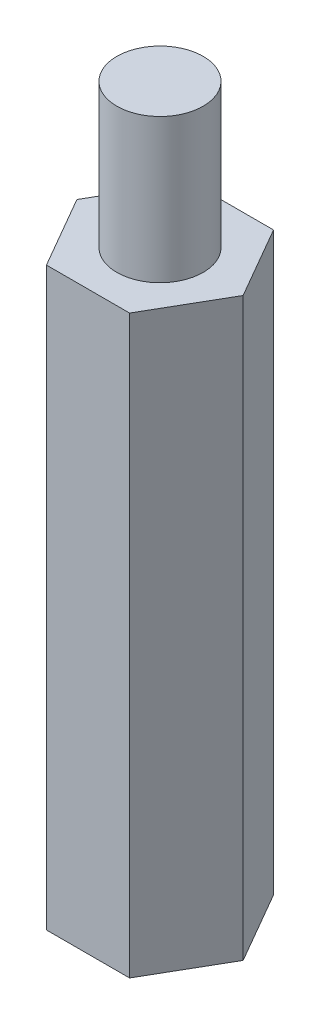
ISO-10303-21;
HEADER;
FILE_DESCRIPTION(('STEP AP214'),'2;1');
FILE_NAME('part.step','',(''),(''),'','','');
FILE_SCHEMA(('AUTOMOTIVE_DESIGN { 1 0 10303 214 1 1 1 1 }'));
ENDSEC;
DATA;
#1=APPLICATION_CONTEXT('core data for automotive mechanical design processes');
#2=APPLICATION_PROTOCOL_DEFINITION('international standard','automotive_design',2000,#1);
#3=PRODUCT_CONTEXT('',#1,'mechanical');
#4=PRODUCT('Part','Part','',(#3));
#5=PRODUCT_RELATED_PRODUCT_CATEGORY('part','',(#4));
#6=PRODUCT_DEFINITION_FORMATION('','',#4);
#7=PRODUCT_DEFINITION_CONTEXT('part definition',#1,'design');
#8=PRODUCT_DEFINITION('design','',#6,#7);
#9=PRODUCT_DEFINITION_SHAPE('','',#8);
#10=(LENGTH_UNIT() NAMED_UNIT(*) SI_UNIT(.MILLI.,.METRE.));
#11=(NAMED_UNIT(*) PLANE_ANGLE_UNIT() SI_UNIT($,.RADIAN.));
#12=(NAMED_UNIT(*) SI_UNIT($,.STERADIAN.) SOLID_ANGLE_UNIT());
#13=UNCERTAINTY_MEASURE_WITH_UNIT(LENGTH_MEASURE(1.E-05),#10,'distance_accuracy_value','');
#14=(GEOMETRIC_REPRESENTATION_CONTEXT(3) GLOBAL_UNCERTAINTY_ASSIGNED_CONTEXT((#13)) GLOBAL_UNIT_ASSIGNED_CONTEXT((#10,
#11,#12)) REPRESENTATION_CONTEXT('',''));
#15=CARTESIAN_POINT('',(0.,0.,0.));
#16=DIRECTION('',(0.,0.,1.));
#17=DIRECTION('',(1.,0.,0.));
#18=AXIS2_PLACEMENT_3D('',#15,#16,#17);
#19=CARTESIAN_POINT('',(1.44337567297409,20.,2.49999999999997));
#20=DIRECTION('',(-0.866025403784442,0.,-0.499999999999995));
#21=DIRECTION('',(-0.499999999999995,0.,0.866025403784442));
#22=AXIS2_PLACEMENT_3D('',#19,#20,#21);
#23=PLANE('',#22);
#24=DIRECTION('',(0.499999999999995,0.,-0.866025403784442));
#25=VECTOR('',#24,1.);
#26=CARTESIAN_POINT('',(1.44337567297409,0.,2.49999999999997));
#27=LINE('',#26,#25);
#28=CARTESIAN_POINT('',(1.44337567297409,0.,2.49999999999997));
#29=VERTEX_POINT('',#28);
#30=CARTESIAN_POINT('',(2.88675134594812,0.,0.));
#31=VERTEX_POINT('',#30);
#32=EDGE_CURVE('E120',#29,#31,#27,.T.);
#33=ORIENTED_EDGE('',*,*,#32,.T.);
#34=DIRECTION('',(0.,-1.,0.));
#35=VECTOR('',#34,1.);
#36=CARTESIAN_POINT('',(2.88675134594812,20.,0.));
#37=LINE('',#36,#35);
#38=CARTESIAN_POINT('',(2.88675134594812,20.,0.));
#39=VERTEX_POINT('',#38);
#40=EDGE_CURVE('E37',#39,#31,#37,.T.);
#41=ORIENTED_EDGE('',*,*,#40,.F.);
#42=DIRECTION('',(0.499999999999995,0.,-0.866025403784442));
#43=VECTOR('',#42,1.);
#44=CARTESIAN_POINT('',(1.44337567297409,20.,2.49999999999997));
#45=LINE('',#44,#43);
#46=CARTESIAN_POINT('',(1.44337567297409,20.,2.49999999999997));
#47=VERTEX_POINT('',#46);
#48=EDGE_CURVE('E131',#47,#39,#45,.T.);
#49=ORIENTED_EDGE('',*,*,#48,.F.);
#50=DIRECTION('',(0.,-1.,0.));
#51=VECTOR('',#50,1.);
#52=CARTESIAN_POINT('',(1.44337567297409,20.,2.49999999999997));
#53=LINE('',#52,#51);
#54=EDGE_CURVE('E116',#47,#29,#53,.T.);
#55=ORIENTED_EDGE('',*,*,#54,.T.);
#56=EDGE_LOOP('',(#33,#41,#49,#55));
#57=FACE_BOUND('',#56,.T.);
#58=ADVANCED_FACE('F34',(#57),#23,.F.);
#59=CARTESIAN_POINT('',(2.88675134594812,20.,0.));
#60=DIRECTION('',(-0.866025403784438,0.,0.500000000000001));
#61=DIRECTION('',(0.500000000000001,0.,0.866025403784438));
#62=AXIS2_PLACEMENT_3D('',#59,#60,#61);
#63=PLANE('',#62);
#64=DIRECTION('',(-0.500000000000001,0.,-0.866025403784438));
#65=VECTOR('',#64,1.);
#66=CARTESIAN_POINT('',(2.88675134594812,0.,0.));
#67=LINE('',#66,#65);
#68=CARTESIAN_POINT('',(1.44337567297405,0.,-2.49999999999999));
#69=VERTEX_POINT('',#68);
#70=EDGE_CURVE('E123',#31,#69,#67,.T.);
#71=ORIENTED_EDGE('',*,*,#70,.T.);
#72=DIRECTION('',(0.,-1.,0.));
#73=VECTOR('',#72,1.);
#74=CARTESIAN_POINT('',(1.44337567297405,20.,-2.49999999999999));
#75=LINE('',#74,#73);
#76=CARTESIAN_POINT('',(1.44337567297405,20.,-2.49999999999999));
#77=VERTEX_POINT('',#76);
#78=EDGE_CURVE('E134',#77,#69,#75,.T.);
#79=ORIENTED_EDGE('',*,*,#78,.F.);
#80=DIRECTION('',(-0.500000000000001,0.,-0.866025403784438));
#81=VECTOR('',#80,1.);
#82=CARTESIAN_POINT('',(2.88675134594812,20.,0.));
#83=LINE('',#82,#81);
#84=EDGE_CURVE('E89',#39,#77,#83,.T.);
#85=ORIENTED_EDGE('',*,*,#84,.F.);
#86=ORIENTED_EDGE('',*,*,#40,.T.);
#87=EDGE_LOOP('',(#71,#79,#85,#86));
#88=FACE_BOUND('',#87,.T.);
#89=ADVANCED_FACE('F139',(#88),#63,.F.);
#90=CARTESIAN_POINT('',(1.44337567297405,20.,-2.49999999999999));
#91=DIRECTION('',(0.,0.,1.));
#92=DIRECTION('',(1.,0.,0.));
#93=AXIS2_PLACEMENT_3D('',#90,#91,#92);
#94=PLANE('',#93);
#95=DIRECTION('',(-1.,0.,0.));
#96=VECTOR('',#95,1.);
#97=CARTESIAN_POINT('',(1.44337567297405,0.,-2.49999999999999));
#98=LINE('',#97,#96);
#99=CARTESIAN_POINT('',(-1.44337567297407,0.,-2.49999999999998));
#100=VERTEX_POINT('',#99);
#101=EDGE_CURVE('E126',#69,#100,#98,.T.);
#102=ORIENTED_EDGE('',*,*,#101,.T.);
#103=DIRECTION('',(0.,-1.,0.));
#104=VECTOR('',#103,1.);
#105=CARTESIAN_POINT('',(-1.44337567297407,20.,-2.49999999999998));
#106=LINE('',#105,#104);
#107=CARTESIAN_POINT('',(-1.44337567297407,20.,-2.49999999999998));
#108=VERTEX_POINT('',#107);
#109=EDGE_CURVE('E111',#108,#100,#106,.T.);
#110=ORIENTED_EDGE('',*,*,#109,.F.);
#111=DIRECTION('',(-1.,0.,0.));
#112=VECTOR('',#111,1.);
#113=CARTESIAN_POINT('',(1.44337567297405,20.,-2.49999999999999));
#114=LINE('',#113,#112);
#115=EDGE_CURVE('E102',#77,#108,#114,.T.);
#116=ORIENTED_EDGE('',*,*,#115,.F.);
#117=ORIENTED_EDGE('',*,*,#78,.T.);
#118=EDGE_LOOP('',(#102,#110,#116,#117));
#119=FACE_BOUND('',#118,.T.);
#120=ADVANCED_FACE('F145',(#119),#94,.F.);
#121=CARTESIAN_POINT('',(-1.44337567297407,20.,-2.49999999999998));
#122=DIRECTION('',(0.866025403784442,0.,0.499999999999995));
#123=DIRECTION('',(0.499999999999995,0.,-0.866025403784441));
#124=AXIS2_PLACEMENT_3D('',#121,#122,#123);
#125=PLANE('',#124);
#126=DIRECTION('',(-0.499999999999995,0.,0.866025403784442));
#127=VECTOR('',#126,1.);
#128=CARTESIAN_POINT('',(-1.44337567297407,0.,-2.49999999999998));
#129=LINE('',#128,#127);
#130=CARTESIAN_POINT('',(-2.88675134594812,0.,0.));
#131=VERTEX_POINT('',#130);
#132=EDGE_CURVE('E110',#100,#131,#129,.T.);
#133=ORIENTED_EDGE('',*,*,#132,.T.);
#134=DIRECTION('',(0.,-1.,0.));
#135=VECTOR('',#134,1.);
#136=CARTESIAN_POINT('',(-2.88675134594812,20.,0.));
#137=LINE('',#136,#135);
#138=CARTESIAN_POINT('',(-2.88675134594812,20.,0.));
#139=VERTEX_POINT('',#138);
#140=EDGE_CURVE('E107',#139,#131,#137,.T.);
#141=ORIENTED_EDGE('',*,*,#140,.F.);
#142=DIRECTION('',(-0.499999999999995,0.,0.866025403784442));
#143=VECTOR('',#142,1.);
#144=CARTESIAN_POINT('',(-1.44337567297407,20.,-2.49999999999998));
#145=LINE('',#144,#143);
#146=EDGE_CURVE('E96',#108,#139,#145,.T.);
#147=ORIENTED_EDGE('',*,*,#146,.F.);
#148=ORIENTED_EDGE('',*,*,#109,.T.);
#149=EDGE_LOOP('',(#133,#141,#147,#148));
#150=FACE_BOUND('',#149,.T.);
#151=ADVANCED_FACE('F108',(#150),#125,.F.);
#152=CARTESIAN_POINT('',(-2.88675134594812,20.,0.));
#153=DIRECTION('',(0.866025403784435,0.,-0.500000000000007));
#154=DIRECTION('',(-0.500000000000007,0.,-0.866025403784435));
#155=AXIS2_PLACEMENT_3D('',#152,#153,#154);
#156=PLANE('',#155);
#157=DIRECTION('',(0.500000000000007,0.,0.866025403784435));
#158=VECTOR('',#157,1.);
#159=CARTESIAN_POINT('',(-2.88675134594812,0.,0.));
#160=LINE('',#159,#158);
#161=CARTESIAN_POINT('',(-1.44337567297404,0.,2.5));
#162=VERTEX_POINT('',#161);
#163=EDGE_CURVE('E74',#131,#162,#160,.T.);
#164=ORIENTED_EDGE('',*,*,#163,.T.);
#165=DIRECTION('',(0.,-1.,0.));
#166=VECTOR('',#165,1.);
#167=CARTESIAN_POINT('',(-1.44337567297404,20.,2.5));
#168=LINE('',#167,#166);
#169=CARTESIAN_POINT('',(-1.44337567297404,20.,2.5));
#170=VERTEX_POINT('',#169);
#171=EDGE_CURVE('E112',#170,#162,#168,.T.);
#172=ORIENTED_EDGE('',*,*,#171,.F.);
#173=DIRECTION('',(0.500000000000007,0.,0.866025403784435));
#174=VECTOR('',#173,1.);
#175=CARTESIAN_POINT('',(-2.88675134594812,20.,0.));
#176=LINE('',#175,#174);
#177=EDGE_CURVE('E100',#139,#170,#176,.T.);
#178=ORIENTED_EDGE('',*,*,#177,.F.);
#179=ORIENTED_EDGE('',*,*,#140,.T.);
#180=EDGE_LOOP('',(#164,#172,#178,#179));
#181=FACE_BOUND('',#180,.T.);
#182=ADVANCED_FACE('F114',(#181),#156,.F.);
#183=CARTESIAN_POINT('',(-1.44337567297404,20.,2.5));
#184=DIRECTION('',(0.,0.,-1.));
#185=DIRECTION('',(-1.,0.,0.));
#186=AXIS2_PLACEMENT_3D('',#183,#184,#185);
#187=PLANE('',#186);
#188=DIRECTION('',(1.,0.,0.));
#189=VECTOR('',#188,1.);
#190=CARTESIAN_POINT('',(-1.44337567297404,0.,2.5));
#191=LINE('',#190,#189);
#192=EDGE_CURVE('E80',#162,#29,#191,.T.);
#193=ORIENTED_EDGE('',*,*,#192,.T.);
#194=ORIENTED_EDGE('',*,*,#54,.F.);
#195=DIRECTION('',(1.,0.,0.));
#196=VECTOR('',#195,1.);
#197=CARTESIAN_POINT('',(-1.44337567297404,20.,2.5));
#198=LINE('',#197,#196);
#199=EDGE_CURVE('E51',#170,#47,#198,.T.);
#200=ORIENTED_EDGE('',*,*,#199,.F.);
#201=ORIENTED_EDGE('',*,*,#171,.T.);
#202=EDGE_LOOP('',(#193,#194,#200,#201));
#203=FACE_BOUND('',#202,.T.);
#204=ADVANCED_FACE('F176',(#203),#187,.F.);
#205=CARTESIAN_POINT('',(0.,20.,0.));
#206=DIRECTION('',(0.,1.,0.));
#207=DIRECTION('',(0.,0.,1.));
#208=AXIS2_PLACEMENT_3D('',#205,#206,#207);
#209=PLANE('',#208);
#210=CARTESIAN_POINT('',(0.,20.,0.));
#211=DIRECTION('',(0.,1.,0.));
#212=DIRECTION('',(0.,0.,1.));
#213=AXIS2_PLACEMENT_3D('',#210,#211,#212);
#214=CIRCLE('',#213,1.5);
#215=CARTESIAN_POINT('',(0.,20.,1.5));
#216=VERTEX_POINT('',#215);
#217=EDGE_CURVE('E11',#216,#216,#214,.T.);
#218=ORIENTED_EDGE('',*,*,#217,.F.);
#219=EDGE_LOOP('',(#218));
#220=FACE_BOUND('',#219,.T.);
#221=ORIENTED_EDGE('',*,*,#48,.T.);
#222=ORIENTED_EDGE('',*,*,#84,.T.);
#223=ORIENTED_EDGE('',*,*,#115,.T.);
#224=ORIENTED_EDGE('',*,*,#146,.T.);
#225=ORIENTED_EDGE('',*,*,#177,.T.);
#226=ORIENTED_EDGE('',*,*,#199,.T.);
#227=EDGE_LOOP('',(#221,#222,#223,#224,#225,#226));
#228=FACE_BOUND('',#227,.T.);
#229=ADVANCED_FACE('F98',(#220,#228),#209,.T.);
#230=CARTESIAN_POINT('',(0.,0.,0.));
#231=DIRECTION('',(0.,1.,0.));
#232=DIRECTION('',(0.,0.,1.));
#233=AXIS2_PLACEMENT_3D('',#230,#231,#232);
#234=PLANE('',#233);
#235=CARTESIAN_POINT('',(0.,0.,0.));
#236=DIRECTION('',(0.,-1.,0.));
#237=DIRECTION('',(0.,0.,-1.));
#238=AXIS2_PLACEMENT_3D('',#235,#236,#237);
#239=CIRCLE('',#238,1.5);
#240=CARTESIAN_POINT('',(0.,0.,-1.5));
#241=VERTEX_POINT('',#240);
#242=EDGE_CURVE('E152',#241,#241,#239,.T.);
#243=ORIENTED_EDGE('',*,*,#242,.F.);
#244=EDGE_LOOP('',(#243));
#245=FACE_BOUND('',#244,.T.);
#246=ORIENTED_EDGE('',*,*,#32,.F.);
#247=ORIENTED_EDGE('',*,*,#192,.F.);
#248=ORIENTED_EDGE('',*,*,#163,.F.);
#249=ORIENTED_EDGE('',*,*,#132,.F.);
#250=ORIENTED_EDGE('',*,*,#101,.F.);
#251=ORIENTED_EDGE('',*,*,#70,.F.);
#252=EDGE_LOOP('',(#246,#247,#248,#249,#250,#251));
#253=FACE_BOUND('',#252,.T.);
#254=ADVANCED_FACE('F144',(#245,#253),#234,.F.);
#255=CARTESIAN_POINT('',(0.,25.,0.));
#256=DIRECTION('',(0.,-1.,0.));
#257=DIRECTION('',(0.,0.,-1.));
#258=AXIS2_PLACEMENT_3D('',#255,#256,#257);
#259=CYLINDRICAL_SURFACE('',#258,1.5);
#260=CARTESIAN_POINT('',(0.,25.,0.));
#261=DIRECTION('',(0.,1.,0.));
#262=DIRECTION('',(0.,0.,1.));
#263=AXIS2_PLACEMENT_3D('',#260,#261,#262);
#264=CIRCLE('',#263,1.5);
#265=CARTESIAN_POINT('',(0.,25.,1.5));
#266=VERTEX_POINT('',#265);
#267=EDGE_CURVE('E124',#266,#266,#264,.T.);
#268=ORIENTED_EDGE('',*,*,#267,.F.);
#269=EDGE_LOOP('',(#268));
#270=FACE_BOUND('',#269,.T.);
#271=ORIENTED_EDGE('',*,*,#217,.T.);
#272=EDGE_LOOP('',(#271));
#273=FACE_BOUND('',#272,.T.);
#274=ADVANCED_FACE('F168',(#270,#273),#259,.T.);
#275=CARTESIAN_POINT('',(0.,25.,0.));
#276=DIRECTION('',(0.,1.,0.));
#277=DIRECTION('',(0.,0.,1.));
#278=AXIS2_PLACEMENT_3D('',#275,#276,#277);
#279=PLANE('',#278);
#280=ORIENTED_EDGE('',*,*,#267,.T.);
#281=EDGE_LOOP('',(#280));
#282=FACE_BOUND('',#281,.T.);
#283=ADVANCED_FACE('F163',(#282),#279,.T.);
#284=CARTESIAN_POINT('',(0.,5.,0.));
#285=DIRECTION('',(0.,-1.,0.));
#286=DIRECTION('',(0.,0.,-1.));
#287=AXIS2_PLACEMENT_3D('',#284,#285,#286);
#288=CYLINDRICAL_SURFACE('',#287,1.5);
#289=CARTESIAN_POINT('',(0.,5.,0.));
#290=DIRECTION('',(0.,-1.,0.));
#291=DIRECTION('',(0.,0.,-1.));
#292=AXIS2_PLACEMENT_3D('',#289,#290,#291);
#293=CIRCLE('',#292,1.5);
#294=CARTESIAN_POINT('',(0.,5.,-1.5));
#295=VERTEX_POINT('',#294);
#296=EDGE_CURVE('E151',#295,#295,#293,.T.);
#297=ORIENTED_EDGE('',*,*,#296,.F.);
#298=EDGE_LOOP('',(#297));
#299=FACE_BOUND('',#298,.T.);
#300=ORIENTED_EDGE('',*,*,#242,.T.);
#301=EDGE_LOOP('',(#300));
#302=FACE_BOUND('',#301,.T.);
#303=ADVANCED_FACE('F160',(#299,#302),#288,.F.);
#304=CARTESIAN_POINT('',(0.,5.,0.));
#305=DIRECTION('',(0.,-1.,0.));
#306=DIRECTION('',(0.,0.,-1.));
#307=AXIS2_PLACEMENT_3D('',#304,#305,#306);
#308=PLANE('',#307);
#309=ORIENTED_EDGE('',*,*,#296,.T.);
#310=EDGE_LOOP('',(#309));
#311=FACE_BOUND('',#310,.T.);
#312=ADVANCED_FACE('F158',(#311),#308,.T.);
#313=CLOSED_SHELL('',(#58,#89,#120,#151,#182,#204,#229,#254,#274,#283,#303,#312));
#314=MANIFOLD_SOLID_BREP('B2',#313);
#315=ADVANCED_BREP_SHAPE_REPRESENTATION('',(#18,#314),#14);
#316=SHAPE_DEFINITION_REPRESENTATION(#9,#315);
ENDSEC;
END-ISO-10303-21;
